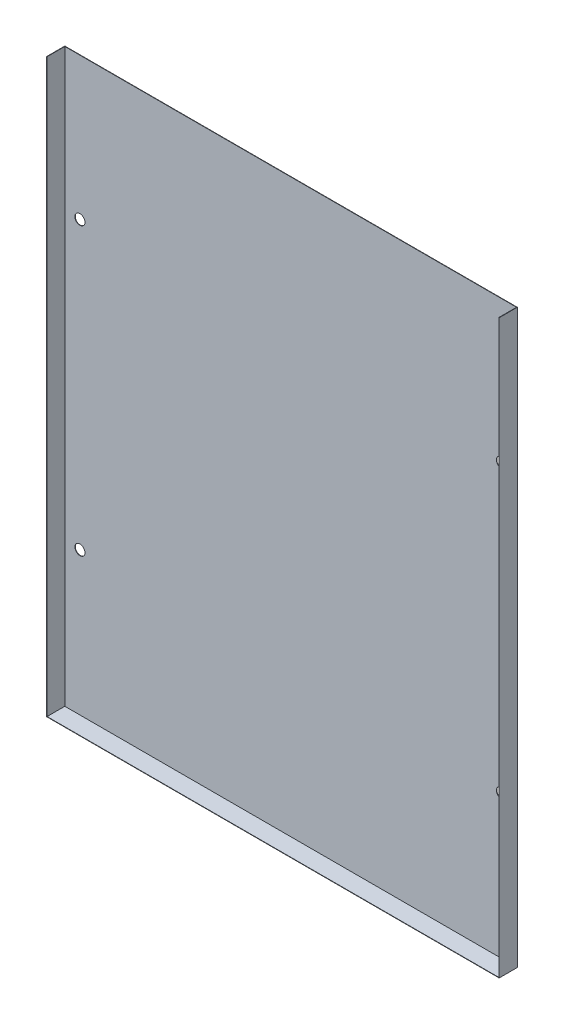
ISO-10303-21;
HEADER;
FILE_DESCRIPTION(('STEP AP214'),'2;1');
FILE_NAME('part.step','',(''),(''),'','','');
FILE_SCHEMA(('AUTOMOTIVE_DESIGN { 1 0 10303 214 1 1 1 1 }'));
ENDSEC;
DATA;
#1=APPLICATION_CONTEXT('core data for automotive mechanical design processes');
#2=APPLICATION_PROTOCOL_DEFINITION('international standard','automotive_design',2000,#1);
#3=PRODUCT_CONTEXT('',#1,'mechanical');
#4=PRODUCT('Part','Part','',(#3));
#5=PRODUCT_RELATED_PRODUCT_CATEGORY('part','',(#4));
#6=PRODUCT_DEFINITION_FORMATION('','',#4);
#7=PRODUCT_DEFINITION_CONTEXT('part definition',#1,'design');
#8=PRODUCT_DEFINITION('design','',#6,#7);
#9=PRODUCT_DEFINITION_SHAPE('','',#8);
#10=(LENGTH_UNIT() NAMED_UNIT(*) SI_UNIT(.MILLI.,.METRE.));
#11=(NAMED_UNIT(*) PLANE_ANGLE_UNIT() SI_UNIT($,.RADIAN.));
#12=(NAMED_UNIT(*) SI_UNIT($,.STERADIAN.) SOLID_ANGLE_UNIT());
#13=UNCERTAINTY_MEASURE_WITH_UNIT(LENGTH_MEASURE(1.E-05),#10,'distance_accuracy_value','');
#14=(GEOMETRIC_REPRESENTATION_CONTEXT(3) GLOBAL_UNCERTAINTY_ASSIGNED_CONTEXT((#13)) GLOBAL_UNIT_ASSIGNED_CONTEXT((#10,
#11,#12)) REPRESENTATION_CONTEXT('',''));
#15=CARTESIAN_POINT('',(0.,0.,0.));
#16=DIRECTION('',(0.,0.,1.));
#17=DIRECTION('',(1.,0.,0.));
#18=AXIS2_PLACEMENT_3D('',#15,#16,#17);
#19=CARTESIAN_POINT('',(0.,113.5,0.1524));
#20=DIRECTION('',(0.,1.,0.));
#21=DIRECTION('',(-1.,0.,0.));
#22=AXIS2_PLACEMENT_3D('',#19,#20,#21);
#23=PLANE('',#22);
#24=DIRECTION('',(1.,0.,0.));
#25=VECTOR('',#24,1.);
#26=CARTESIAN_POINT('',(0.,113.5,0.));
#27=LINE('',#26,#25);
#28=CARTESIAN_POINT('',(-89.8724,113.5,0.));
#29=VERTEX_POINT('',#28);
#30=CARTESIAN_POINT('',(89.8724,113.5,0.));
#31=VERTEX_POINT('',#30);
#32=EDGE_CURVE('E41',#29,#31,#27,.T.);
#33=ORIENTED_EDGE('',*,*,#32,.F.);
#34=DIRECTION('',(0.,0.,-1.));
#35=VECTOR('',#34,1.);
#36=CARTESIAN_POINT('',(-89.8724,113.5,7.2048));
#37=LINE('',#36,#35);
#38=CARTESIAN_POINT('',(-89.8724,113.5,7.2048));
#39=VERTEX_POINT('',#38);
#40=EDGE_CURVE('E171',#39,#29,#37,.T.);
#41=ORIENTED_EDGE('',*,*,#40,.F.);
#42=DIRECTION('',(-1.,0.,0.));
#43=VECTOR('',#42,1.);
#44=CARTESIAN_POINT('',(-89.8724,113.5,7.2048));
#45=LINE('',#44,#43);
#46=CARTESIAN_POINT('',(-89.72,113.5,7.2048));
#47=VERTEX_POINT('',#46);
#48=EDGE_CURVE('E165',#47,#39,#45,.T.);
#49=ORIENTED_EDGE('',*,*,#48,.F.);
#50=DIRECTION('',(0.,0.,-1.));
#51=VECTOR('',#50,1.);
#52=CARTESIAN_POINT('',(-89.72,113.5,7.2048));
#53=LINE('',#52,#51);
#54=CARTESIAN_POINT('',(-89.72,113.5,0.1524));
#55=VERTEX_POINT('',#54);
#56=EDGE_CURVE('E174',#47,#55,#53,.T.);
#57=ORIENTED_EDGE('',*,*,#56,.T.);
#58=DIRECTION('',(1.,0.,0.));
#59=VECTOR('',#58,1.);
#60=CARTESIAN_POINT('',(0.,113.5,0.1524));
#61=LINE('',#60,#59);
#62=CARTESIAN_POINT('',(89.72,113.5,0.1524));
#63=VERTEX_POINT('',#62);
#64=EDGE_CURVE('E185',#55,#63,#61,.T.);
#65=ORIENTED_EDGE('',*,*,#64,.T.);
#66=DIRECTION('',(0.,0.,-1.));
#67=VECTOR('',#66,1.);
#68=CARTESIAN_POINT('',(89.72,113.5,7.2048));
#69=LINE('',#68,#67);
#70=CARTESIAN_POINT('',(89.72,113.5,7.2048));
#71=VERTEX_POINT('',#70);
#72=EDGE_CURVE('E142',#71,#63,#69,.T.);
#73=ORIENTED_EDGE('',*,*,#72,.F.);
#74=DIRECTION('',(1.,0.,0.));
#75=VECTOR('',#74,1.);
#76=CARTESIAN_POINT('',(89.8724,113.5,7.2048));
#77=LINE('',#76,#75);
#78=CARTESIAN_POINT('',(89.8724,113.5,7.2048));
#79=VERTEX_POINT('',#78);
#80=EDGE_CURVE('E131',#71,#79,#77,.T.);
#81=ORIENTED_EDGE('',*,*,#80,.T.);
#82=DIRECTION('',(0.,0.,-1.));
#83=VECTOR('',#82,1.);
#84=CARTESIAN_POINT('',(89.8724,113.5,7.2048));
#85=LINE('',#84,#83);
#86=EDGE_CURVE('E127',#79,#31,#85,.T.);
#87=ORIENTED_EDGE('',*,*,#86,.T.);
#88=EDGE_LOOP('',(#33,#41,#49,#57,#65,#73,#81,#87));
#89=FACE_BOUND('',#88,.T.);
#90=ADVANCED_FACE('F37',(#89),#23,.T.);
#91=CARTESIAN_POINT('',(-83.72,-56.6738,0.1524));
#92=DIRECTION('',(0.,0.,-1.));
#93=DIRECTION('',(-1.,0.,0.));
#94=AXIS2_PLACEMENT_3D('',#91,#92,#93);
#95=CYLINDRICAL_SURFACE('',#94,2.);
#96=CARTESIAN_POINT('',(-83.72,-56.6738,0.1524));
#97=DIRECTION('',(0.,0.,1.));
#98=DIRECTION('',(1.,0.,0.));
#99=AXIS2_PLACEMENT_3D('',#96,#97,#98);
#100=CIRCLE('',#99,2.);
#101=CARTESIAN_POINT('',(-81.72,-56.6738,0.1524));
#102=VERTEX_POINT('',#101);
#103=EDGE_CURVE('E182',#102,#102,#100,.T.);
#104=ORIENTED_EDGE('',*,*,#103,.T.);
#105=EDGE_LOOP('',(#104));
#106=FACE_BOUND('',#105,.T.);
#107=CARTESIAN_POINT('',(-83.72,-56.6738,0.));
#108=DIRECTION('',(0.,0.,1.));
#109=DIRECTION('',(1.,0.,0.));
#110=AXIS2_PLACEMENT_3D('',#107,#108,#109);
#111=CIRCLE('',#110,2.);
#112=CARTESIAN_POINT('',(-81.72,-56.6738,0.));
#113=VERTEX_POINT('',#112);
#114=EDGE_CURVE('E189',#113,#113,#111,.T.);
#115=ORIENTED_EDGE('',*,*,#114,.F.);
#116=EDGE_LOOP('',(#115));
#117=FACE_BOUND('',#116,.T.);
#118=ADVANCED_FACE('F219',(#106,#117),#95,.F.);
#119=CARTESIAN_POINT('',(-83.72,56.9786,0.1524));
#120=DIRECTION('',(0.,0.,-1.));
#121=DIRECTION('',(-1.,0.,0.));
#122=AXIS2_PLACEMENT_3D('',#119,#120,#121);
#123=CYLINDRICAL_SURFACE('',#122,2.);
#124=CARTESIAN_POINT('',(-83.72,56.9786,0.1524));
#125=DIRECTION('',(0.,0.,1.));
#126=DIRECTION('',(1.,0.,0.));
#127=AXIS2_PLACEMENT_3D('',#124,#125,#126);
#128=CIRCLE('',#127,2.);
#129=CARTESIAN_POINT('',(-81.72,56.9786,0.1524));
#130=VERTEX_POINT('',#129);
#131=EDGE_CURVE('E179',#130,#130,#128,.T.);
#132=ORIENTED_EDGE('',*,*,#131,.T.);
#133=EDGE_LOOP('',(#132));
#134=FACE_BOUND('',#133,.T.);
#135=CARTESIAN_POINT('',(-83.72,56.9786,0.));
#136=DIRECTION('',(0.,0.,1.));
#137=DIRECTION('',(1.,0.,0.));
#138=AXIS2_PLACEMENT_3D('',#135,#136,#137);
#139=CIRCLE('',#138,2.);
#140=CARTESIAN_POINT('',(-81.72,56.9786,0.));
#141=VERTEX_POINT('',#140);
#142=EDGE_CURVE('E178',#141,#141,#139,.T.);
#143=ORIENTED_EDGE('',*,*,#142,.F.);
#144=EDGE_LOOP('',(#143));
#145=FACE_BOUND('',#144,.T.);
#146=ADVANCED_FACE('F39',(#134,#145),#123,.F.);
#147=CARTESIAN_POINT('',(0.,0.,0.1524));
#148=DIRECTION('',(0.,0.,1.));
#149=DIRECTION('',(1.,0.,0.));
#150=AXIS2_PLACEMENT_3D('',#147,#148,#149);
#151=PLANE('',#150);
#152=ORIENTED_EDGE('',*,*,#131,.F.);
#153=EDGE_LOOP('',(#152));
#154=FACE_BOUND('',#153,.T.);
#155=ORIENTED_EDGE('',*,*,#103,.F.);
#156=EDGE_LOOP('',(#155));
#157=FACE_BOUND('',#156,.T.);
#158=DIRECTION('',(1.,0.,0.));
#159=VECTOR('',#158,1.);
#160=CARTESIAN_POINT('',(0.,-113.5,0.1524));
#161=LINE('',#160,#159);
#162=CARTESIAN_POINT('',(-89.72,-113.5,0.1524));
#163=VERTEX_POINT('',#162);
#164=CARTESIAN_POINT('',(89.72,-113.5,0.1524));
#165=VERTEX_POINT('',#164);
#166=EDGE_CURVE('E11',#163,#165,#161,.T.);
#167=ORIENTED_EDGE('',*,*,#166,.T.);
#168=DIRECTION('',(0.,1.,0.));
#169=VECTOR('',#168,1.);
#170=CARTESIAN_POINT('',(89.72,0.,0.1524));
#171=LINE('',#170,#169);
#172=EDGE_CURVE('E153',#165,#63,#171,.T.);
#173=ORIENTED_EDGE('',*,*,#172,.T.);
#174=ORIENTED_EDGE('',*,*,#64,.F.);
#175=DIRECTION('',(0.,1.,0.));
#176=VECTOR('',#175,1.);
#177=CARTESIAN_POINT('',(-89.72,0.,0.1524));
#178=LINE('',#177,#176);
#179=EDGE_CURVE('E46',#163,#55,#178,.T.);
#180=ORIENTED_EDGE('',*,*,#179,.F.);
#181=EDGE_LOOP('',(#167,#173,#174,#180));
#182=FACE_BOUND('',#181,.T.);
#183=CARTESIAN_POINT('',(83.72,56.9786,0.1524));
#184=DIRECTION('',(0.,0.,-1.));
#185=DIRECTION('',(-1.,0.,0.));
#186=AXIS2_PLACEMENT_3D('',#183,#184,#185);
#187=CIRCLE('',#186,2.);
#188=CARTESIAN_POINT('',(81.72,56.9786,0.1524));
#189=VERTEX_POINT('',#188);
#190=EDGE_CURVE('E146',#189,#189,#187,.T.);
#191=ORIENTED_EDGE('',*,*,#190,.T.);
#192=EDGE_LOOP('',(#191));
#193=FACE_BOUND('',#192,.T.);
#194=CARTESIAN_POINT('',(83.72,-56.6738,0.1524));
#195=DIRECTION('',(0.,0.,-1.));
#196=DIRECTION('',(-1.,0.,0.));
#197=AXIS2_PLACEMENT_3D('',#194,#195,#196);
#198=CIRCLE('',#197,2.);
#199=CARTESIAN_POINT('',(81.72,-56.6738,0.1524));
#200=VERTEX_POINT('',#199);
#201=EDGE_CURVE('E149',#200,#200,#198,.T.);
#202=ORIENTED_EDGE('',*,*,#201,.T.);
#203=EDGE_LOOP('',(#202));
#204=FACE_BOUND('',#203,.T.);
#205=ADVANCED_FACE('F228',(#154,#157,#182,#193,#204),#151,.T.);
#206=CARTESIAN_POINT('',(0.,0.,0.));
#207=DIRECTION('',(0.,0.,1.));
#208=DIRECTION('',(1.,0.,0.));
#209=AXIS2_PLACEMENT_3D('',#206,#207,#208);
#210=PLANE('',#209);
#211=DIRECTION('',(0.,-1.,0.));
#212=VECTOR('',#211,1.);
#213=CARTESIAN_POINT('',(89.8724,113.5,0.));
#214=LINE('',#213,#212);
#215=CARTESIAN_POINT('',(89.8724,-113.6524,0.));
#216=VERTEX_POINT('',#215);
#217=EDGE_CURVE('E132',#31,#216,#214,.T.);
#218=ORIENTED_EDGE('',*,*,#217,.T.);
#219=DIRECTION('',(1.,0.,0.));
#220=VECTOR('',#219,1.);
#221=CARTESIAN_POINT('',(-89.8724,-113.6524,0.));
#222=LINE('',#221,#220);
#223=CARTESIAN_POINT('',(-89.8724,-113.6524,0.));
#224=VERTEX_POINT('',#223);
#225=EDGE_CURVE('E122',#224,#216,#222,.T.);
#226=ORIENTED_EDGE('',*,*,#225,.F.);
#227=DIRECTION('',(0.,-1.,0.));
#228=VECTOR('',#227,1.);
#229=CARTESIAN_POINT('',(-89.8724,113.5,0.));
#230=LINE('',#229,#228);
#231=EDGE_CURVE('E156',#29,#224,#230,.T.);
#232=ORIENTED_EDGE('',*,*,#231,.F.);
#233=ORIENTED_EDGE('',*,*,#32,.T.);
#234=EDGE_LOOP('',(#218,#226,#232,#233));
#235=FACE_BOUND('',#234,.T.);
#236=ORIENTED_EDGE('',*,*,#142,.T.);
#237=EDGE_LOOP('',(#236));
#238=FACE_BOUND('',#237,.T.);
#239=ORIENTED_EDGE('',*,*,#114,.T.);
#240=EDGE_LOOP('',(#239));
#241=FACE_BOUND('',#240,.T.);
#242=CARTESIAN_POINT('',(83.72,56.9786,0.));
#243=DIRECTION('',(0.,0.,-1.));
#244=DIRECTION('',(-1.,0.,0.));
#245=AXIS2_PLACEMENT_3D('',#242,#243,#244);
#246=CIRCLE('',#245,2.);
#247=CARTESIAN_POINT('',(81.72,56.9786,0.));
#248=VERTEX_POINT('',#247);
#249=EDGE_CURVE('E126',#248,#248,#246,.T.);
#250=ORIENTED_EDGE('',*,*,#249,.F.);
#251=EDGE_LOOP('',(#250));
#252=FACE_BOUND('',#251,.T.);
#253=CARTESIAN_POINT('',(83.72,-56.6738,0.));
#254=DIRECTION('',(0.,0.,-1.));
#255=DIRECTION('',(-1.,0.,0.));
#256=AXIS2_PLACEMENT_3D('',#253,#254,#255);
#257=CIRCLE('',#256,2.);
#258=CARTESIAN_POINT('',(81.72,-56.6738,0.));
#259=VERTEX_POINT('',#258);
#260=EDGE_CURVE('E150',#259,#259,#257,.T.);
#261=ORIENTED_EDGE('',*,*,#260,.F.);
#262=EDGE_LOOP('',(#261));
#263=FACE_BOUND('',#262,.T.);
#264=ADVANCED_FACE('F195',(#235,#238,#241,#252,#263),#210,.F.);
#265=CARTESIAN_POINT('',(-89.72,-113.5,7.2048));
#266=DIRECTION('',(0.,-1.,0.));
#267=DIRECTION('',(1.,0.,0.));
#268=AXIS2_PLACEMENT_3D('',#265,#266,#267);
#269=PLANE('',#268);
#270=ORIENTED_EDGE('',*,*,#166,.F.);
#271=DIRECTION('',(0.,0.,-1.));
#272=VECTOR('',#271,1.);
#273=CARTESIAN_POINT('',(-89.72,-113.5,7.2048));
#274=LINE('',#273,#272);
#275=CARTESIAN_POINT('',(-89.72,-113.5,7.2048));
#276=VERTEX_POINT('',#275);
#277=EDGE_CURVE('E176',#276,#163,#274,.T.);
#278=ORIENTED_EDGE('',*,*,#277,.F.);
#279=DIRECTION('',(-1.,0.,0.));
#280=VECTOR('',#279,1.);
#281=CARTESIAN_POINT('',(-89.72,-113.5,7.2048));
#282=LINE('',#281,#280);
#283=CARTESIAN_POINT('',(89.72,-113.5,7.2048));
#284=VERTEX_POINT('',#283);
#285=EDGE_CURVE('E161',#284,#276,#282,.T.);
#286=ORIENTED_EDGE('',*,*,#285,.F.);
#287=DIRECTION('',(0.,0.,-1.));
#288=VECTOR('',#287,1.);
#289=CARTESIAN_POINT('',(89.72,-113.5,7.2048));
#290=LINE('',#289,#288);
#291=EDGE_CURVE('E139',#284,#165,#290,.T.);
#292=ORIENTED_EDGE('',*,*,#291,.T.);
#293=EDGE_LOOP('',(#270,#278,#286,#292));
#294=FACE_BOUND('',#293,.T.);
#295=ADVANCED_FACE('F204',(#294),#269,.F.);
#296=CARTESIAN_POINT('',(-89.72,-113.5,7.2048));
#297=DIRECTION('',(-1.,0.,0.));
#298=DIRECTION('',(0.,0.,1.));
#299=AXIS2_PLACEMENT_3D('',#296,#297,#298);
#300=PLANE('',#299);
#301=ORIENTED_EDGE('',*,*,#179,.T.);
#302=ORIENTED_EDGE('',*,*,#56,.F.);
#303=DIRECTION('',(0.,1.,0.));
#304=VECTOR('',#303,1.);
#305=CARTESIAN_POINT('',(-89.72,-113.5,7.2048));
#306=LINE('',#305,#304);
#307=EDGE_CURVE('E163',#276,#47,#306,.T.);
#308=ORIENTED_EDGE('',*,*,#307,.F.);
#309=ORIENTED_EDGE('',*,*,#277,.T.);
#310=EDGE_LOOP('',(#301,#302,#308,#309));
#311=FACE_BOUND('',#310,.T.);
#312=ADVANCED_FACE('F206',(#311),#300,.F.);
#313=CARTESIAN_POINT('',(-89.8724,113.5,7.2048));
#314=DIRECTION('',(1.,0.,0.));
#315=DIRECTION('',(0.,0.,-1.));
#316=AXIS2_PLACEMENT_3D('',#313,#314,#315);
#317=PLANE('',#316);
#318=ORIENTED_EDGE('',*,*,#231,.T.);
#319=DIRECTION('',(0.,0.,-1.));
#320=VECTOR('',#319,1.);
#321=CARTESIAN_POINT('',(-89.8724,-113.6524,7.2048));
#322=LINE('',#321,#320);
#323=CARTESIAN_POINT('',(-89.8724,-113.6524,7.2048));
#324=VERTEX_POINT('',#323);
#325=EDGE_CURVE('E116',#324,#224,#322,.T.);
#326=ORIENTED_EDGE('',*,*,#325,.F.);
#327=DIRECTION('',(0.,-1.,0.));
#328=VECTOR('',#327,1.);
#329=CARTESIAN_POINT('',(-89.8724,113.5,7.2048));
#330=LINE('',#329,#328);
#331=EDGE_CURVE('E112',#39,#324,#330,.T.);
#332=ORIENTED_EDGE('',*,*,#331,.F.);
#333=ORIENTED_EDGE('',*,*,#40,.T.);
#334=EDGE_LOOP('',(#318,#326,#332,#333));
#335=FACE_BOUND('',#334,.T.);
#336=ADVANCED_FACE('F209',(#335),#317,.F.);
#337=CARTESIAN_POINT('',(-89.8724,-113.6524,7.2048));
#338=DIRECTION('',(0.,1.,0.));
#339=DIRECTION('',(-1.,0.,0.));
#340=AXIS2_PLACEMENT_3D('',#337,#338,#339);
#341=PLANE('',#340);
#342=ORIENTED_EDGE('',*,*,#225,.T.);
#343=DIRECTION('',(0.,0.,-1.));
#344=VECTOR('',#343,1.);
#345=CARTESIAN_POINT('',(89.8724,-113.6524,7.2048));
#346=LINE('',#345,#344);
#347=CARTESIAN_POINT('',(89.8724,-113.6524,7.2048));
#348=VERTEX_POINT('',#347);
#349=EDGE_CURVE('E119',#348,#216,#346,.T.);
#350=ORIENTED_EDGE('',*,*,#349,.F.);
#351=DIRECTION('',(1.,0.,0.));
#352=VECTOR('',#351,1.);
#353=CARTESIAN_POINT('',(-89.8724,-113.6524,7.2048));
#354=LINE('',#353,#352);
#355=EDGE_CURVE('E103',#324,#348,#354,.T.);
#356=ORIENTED_EDGE('',*,*,#355,.F.);
#357=ORIENTED_EDGE('',*,*,#325,.T.);
#358=EDGE_LOOP('',(#342,#350,#356,#357));
#359=FACE_BOUND('',#358,.T.);
#360=ADVANCED_FACE('F120',(#359),#341,.F.);
#361=CARTESIAN_POINT('',(0.,0.,7.2048));
#362=DIRECTION('',(0.,0.,1.));
#363=DIRECTION('',(1.,0.,0.));
#364=AXIS2_PLACEMENT_3D('',#361,#362,#363);
#365=PLANE('',#364);
#366=ORIENTED_EDGE('',*,*,#285,.T.);
#367=ORIENTED_EDGE('',*,*,#307,.T.);
#368=ORIENTED_EDGE('',*,*,#48,.T.);
#369=ORIENTED_EDGE('',*,*,#331,.T.);
#370=ORIENTED_EDGE('',*,*,#355,.T.);
#371=DIRECTION('',(0.,-1.,0.));
#372=VECTOR('',#371,1.);
#373=CARTESIAN_POINT('',(89.8724,113.5,7.2048));
#374=LINE('',#373,#372);
#375=EDGE_CURVE('E109',#79,#348,#374,.T.);
#376=ORIENTED_EDGE('',*,*,#375,.F.);
#377=ORIENTED_EDGE('',*,*,#80,.F.);
#378=DIRECTION('',(0.,1.,0.));
#379=VECTOR('',#378,1.);
#380=CARTESIAN_POINT('',(89.72,-113.5,7.2048));
#381=LINE('',#380,#379);
#382=EDGE_CURVE('E134',#284,#71,#381,.T.);
#383=ORIENTED_EDGE('',*,*,#382,.F.);
#384=EDGE_LOOP('',(#366,#367,#368,#369,#370,#376,#377,#383));
#385=FACE_BOUND('',#384,.T.);
#386=ADVANCED_FACE('F106',(#385),#365,.T.);
#387=CARTESIAN_POINT('',(83.72,-56.6738,0.1524));
#388=DIRECTION('',(0.,0.,-1.));
#389=DIRECTION('',(-1.,0.,0.));
#390=AXIS2_PLACEMENT_3D('',#387,#388,#389);
#391=CYLINDRICAL_SURFACE('',#390,2.);
#392=ORIENTED_EDGE('',*,*,#201,.F.);
#393=EDGE_LOOP('',(#392));
#394=FACE_BOUND('',#393,.T.);
#395=ORIENTED_EDGE('',*,*,#260,.T.);
#396=EDGE_LOOP('',(#395));
#397=FACE_BOUND('',#396,.T.);
#398=ADVANCED_FACE('F296',(#394,#397),#391,.F.);
#399=CARTESIAN_POINT('',(83.72,56.9786,0.1524));
#400=DIRECTION('',(0.,0.,-1.));
#401=DIRECTION('',(-1.,0.,0.));
#402=AXIS2_PLACEMENT_3D('',#399,#400,#401);
#403=CYLINDRICAL_SURFACE('',#402,2.);
#404=ORIENTED_EDGE('',*,*,#190,.F.);
#405=EDGE_LOOP('',(#404));
#406=FACE_BOUND('',#405,.T.);
#407=ORIENTED_EDGE('',*,*,#249,.T.);
#408=EDGE_LOOP('',(#407));
#409=FACE_BOUND('',#408,.T.);
#410=ADVANCED_FACE('F307',(#406,#409),#403,.F.);
#411=CARTESIAN_POINT('',(89.8724,113.5,7.2048));
#412=DIRECTION('',(1.,0.,0.));
#413=DIRECTION('',(0.,0.,-1.));
#414=AXIS2_PLACEMENT_3D('',#411,#412,#413);
#415=PLANE('',#414);
#416=ORIENTED_EDGE('',*,*,#217,.F.);
#417=ORIENTED_EDGE('',*,*,#86,.F.);
#418=ORIENTED_EDGE('',*,*,#375,.T.);
#419=ORIENTED_EDGE('',*,*,#349,.T.);
#420=EDGE_LOOP('',(#416,#417,#418,#419));
#421=FACE_BOUND('',#420,.T.);
#422=ADVANCED_FACE('F129',(#421),#415,.T.);
#423=CARTESIAN_POINT('',(89.72,-113.5,7.2048));
#424=DIRECTION('',(-1.,0.,0.));
#425=DIRECTION('',(0.,0.,1.));
#426=AXIS2_PLACEMENT_3D('',#423,#424,#425);
#427=PLANE('',#426);
#428=ORIENTED_EDGE('',*,*,#72,.T.);
#429=ORIENTED_EDGE('',*,*,#172,.F.);
#430=ORIENTED_EDGE('',*,*,#291,.F.);
#431=ORIENTED_EDGE('',*,*,#382,.T.);
#432=EDGE_LOOP('',(#428,#429,#430,#431));
#433=FACE_BOUND('',#432,.T.);
#434=ADVANCED_FACE('F202',(#433),#427,.T.);
#435=CLOSED_SHELL('',(#90,#118,#146,#205,#264,#295,#312,#336,#360,#386,#398,#410,#422,#434));
#436=MANIFOLD_SOLID_BREP('B2',#435);
#437=ADVANCED_BREP_SHAPE_REPRESENTATION('',(#18,#436),#14);
#438=SHAPE_DEFINITION_REPRESENTATION(#9,#437);
ENDSEC;
END-ISO-10303-21;
